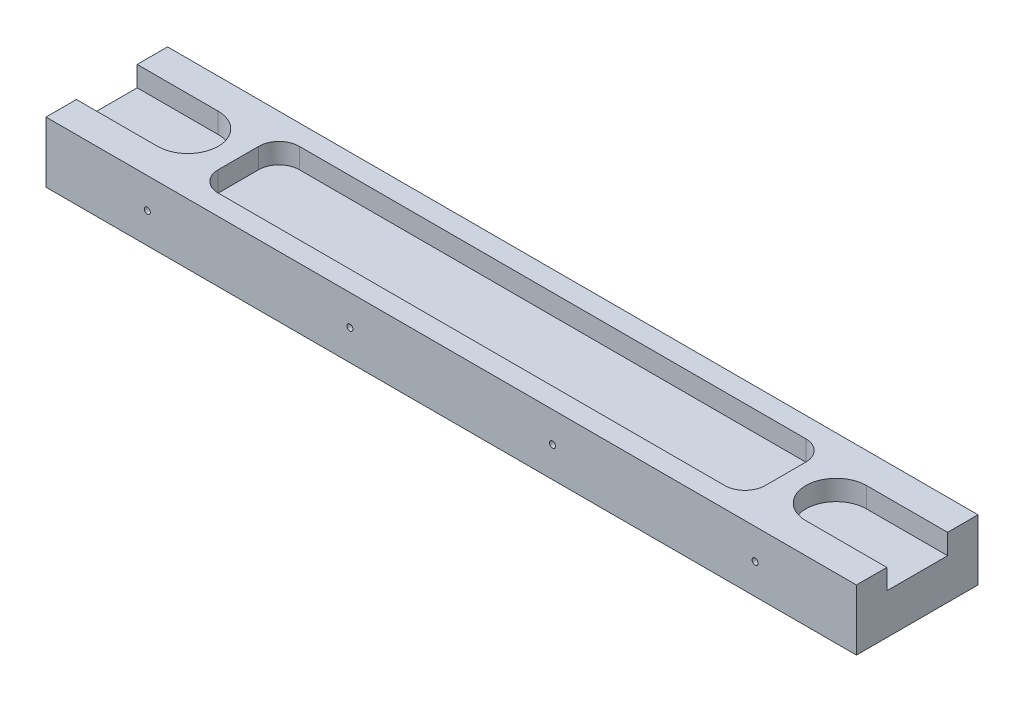
ISO-10303-21;
HEADER;
FILE_DESCRIPTION(('STEP AP214'),'2;1');
FILE_NAME('part.step','',(''),(''),'','','');
FILE_SCHEMA(('AUTOMOTIVE_DESIGN { 1 0 10303 214 1 1 1 1 }'));
ENDSEC;
DATA;
#1=APPLICATION_CONTEXT('core data for automotive mechanical design processes');
#2=APPLICATION_PROTOCOL_DEFINITION('international standard','automotive_design',2000,#1);
#3=PRODUCT_CONTEXT('',#1,'mechanical');
#4=PRODUCT('Part','Part','',(#3));
#5=PRODUCT_RELATED_PRODUCT_CATEGORY('part','',(#4));
#6=PRODUCT_DEFINITION_FORMATION('','',#4);
#7=PRODUCT_DEFINITION_CONTEXT('part definition',#1,'design');
#8=PRODUCT_DEFINITION('design','',#6,#7);
#9=PRODUCT_DEFINITION_SHAPE('','',#8);
#10=(LENGTH_UNIT() NAMED_UNIT(*) SI_UNIT(.MILLI.,.METRE.));
#11=(NAMED_UNIT(*) PLANE_ANGLE_UNIT() SI_UNIT($,.RADIAN.));
#12=(NAMED_UNIT(*) SI_UNIT($,.STERADIAN.) SOLID_ANGLE_UNIT());
#13=UNCERTAINTY_MEASURE_WITH_UNIT(LENGTH_MEASURE(1.E-05),#10,'distance_accuracy_value','');
#14=(GEOMETRIC_REPRESENTATION_CONTEXT(3) GLOBAL_UNCERTAINTY_ASSIGNED_CONTEXT((#13)) GLOBAL_UNIT_ASSIGNED_CONTEXT((#10,
#11,#12)) REPRESENTATION_CONTEXT('',''));
#15=CARTESIAN_POINT('',(0.,0.,0.));
#16=DIRECTION('',(0.,0.,1.));
#17=DIRECTION('',(1.,0.,0.));
#18=AXIS2_PLACEMENT_3D('',#15,#16,#17);
#19=CARTESIAN_POINT('',(0.,15.,0.));
#20=DIRECTION('',(1.,0.,0.));
#21=DIRECTION('',(0.,0.,-1.));
#22=AXIS2_PLACEMENT_3D('',#19,#20,#21);
#23=PLANE('',#22);
#24=DIRECTION('',(0.,0.,1.));
#25=VECTOR('',#24,1.);
#26=CARTESIAN_POINT('',(0.,10.,0.));
#27=LINE('',#26,#25);
#28=CARTESIAN_POINT('',(0.,10.,-22.5));
#29=VERTEX_POINT('',#28);
#30=CARTESIAN_POINT('',(0.,10.,-7.5));
#31=VERTEX_POINT('',#30);
#32=EDGE_CURVE('E11',#29,#31,#27,.T.);
#33=ORIENTED_EDGE('',*,*,#32,.F.);
#34=DIRECTION('',(0.,1.,0.));
#35=VECTOR('',#34,1.);
#36=CARTESIAN_POINT('',(0.,15.,-22.5));
#37=LINE('',#36,#35);
#38=CARTESIAN_POINT('',(0.,15.,-22.5));
#39=VERTEX_POINT('',#38);
#40=EDGE_CURVE('E312',#29,#39,#37,.T.);
#41=ORIENTED_EDGE('',*,*,#40,.T.);
#42=DIRECTION('',(0.,0.,1.));
#43=VECTOR('',#42,1.);
#44=CARTESIAN_POINT('',(0.,15.,0.));
#45=LINE('',#44,#43);
#46=CARTESIAN_POINT('',(0.,15.,-30.));
#47=VERTEX_POINT('',#46);
#48=EDGE_CURVE('E316',#47,#39,#45,.T.);
#49=ORIENTED_EDGE('',*,*,#48,.F.);
#50=DIRECTION('',(0.,-1.,0.));
#51=VECTOR('',#50,1.);
#52=CARTESIAN_POINT('',(0.,15.,-30.));
#53=LINE('',#52,#51);
#54=CARTESIAN_POINT('',(0.,0.,-30.));
#55=VERTEX_POINT('',#54);
#56=EDGE_CURVE('E328',#47,#55,#53,.T.);
#57=ORIENTED_EDGE('',*,*,#56,.T.);
#58=DIRECTION('',(0.,0.,1.));
#59=VECTOR('',#58,1.);
#60=CARTESIAN_POINT('',(0.,0.,0.));
#61=LINE('',#60,#59);
#62=CARTESIAN_POINT('',(0.,0.,0.));
#63=VERTEX_POINT('',#62);
#64=EDGE_CURVE('E315',#55,#63,#61,.T.);
#65=ORIENTED_EDGE('',*,*,#64,.T.);
#66=DIRECTION('',(0.,-1.,0.));
#67=VECTOR('',#66,1.);
#68=CARTESIAN_POINT('',(0.,15.,0.));
#69=LINE('',#68,#67);
#70=CARTESIAN_POINT('',(0.,15.,0.));
#71=VERTEX_POINT('',#70);
#72=EDGE_CURVE('E345',#71,#63,#69,.T.);
#73=ORIENTED_EDGE('',*,*,#72,.F.);
#74=CARTESIAN_POINT('',(0.,15.,-7.50000000000001));
#75=VERTEX_POINT('',#74);
#76=EDGE_CURVE('E320',#75,#71,#45,.T.);
#77=ORIENTED_EDGE('',*,*,#76,.F.);
#78=DIRECTION('',(0.,-1.,0.));
#79=VECTOR('',#78,1.);
#80=CARTESIAN_POINT('',(0.,15.,-7.5));
#81=LINE('',#80,#79);
#82=EDGE_CURVE('E309',#75,#31,#81,.T.);
#83=ORIENTED_EDGE('',*,*,#82,.T.);
#84=EDGE_LOOP('',(#33,#41,#49,#57,#65,#73,#77,#83));
#85=FACE_BOUND('',#84,.T.);
#86=ADVANCED_FACE('F39',(#85),#23,.F.);
#87=CARTESIAN_POINT('',(0.,15.,0.));
#88=DIRECTION('',(0.,0.,-1.));
#89=DIRECTION('',(-1.,0.,0.));
#90=AXIS2_PLACEMENT_3D('',#87,#88,#89);
#91=PLANE('',#90);
#92=CARTESIAN_POINT('',(25.,7.5,0.));
#93=DIRECTION('',(0.,0.,1.));
#94=DIRECTION('',(1.,0.,0.));
#95=AXIS2_PLACEMENT_3D('',#92,#93,#94);
#96=CIRCLE('',#95,0.750000000000002);
#97=CARTESIAN_POINT('',(25.75,7.5,0.));
#98=VERTEX_POINT('',#97);
#99=EDGE_CURVE('E246',#98,#98,#96,.T.);
#100=ORIENTED_EDGE('',*,*,#99,.F.);
#101=EDGE_LOOP('',(#100));
#102=FACE_BOUND('',#101,.T.);
#103=CARTESIAN_POINT('',(75.,7.5,0.));
#104=DIRECTION('',(0.,0.,1.));
#105=DIRECTION('',(1.,0.,0.));
#106=AXIS2_PLACEMENT_3D('',#103,#104,#105);
#107=CIRCLE('',#106,0.749999999999999);
#108=CARTESIAN_POINT('',(75.75,7.5,0.));
#109=VERTEX_POINT('',#108);
#110=EDGE_CURVE('E250',#109,#109,#107,.T.);
#111=ORIENTED_EDGE('',*,*,#110,.F.);
#112=EDGE_LOOP('',(#111));
#113=FACE_BOUND('',#112,.T.);
#114=CARTESIAN_POINT('',(125.,7.5,0.));
#115=DIRECTION('',(0.,0.,1.));
#116=DIRECTION('',(1.,0.,0.));
#117=AXIS2_PLACEMENT_3D('',#114,#115,#116);
#118=CIRCLE('',#117,0.750000000000012);
#119=CARTESIAN_POINT('',(125.75,7.5,0.));
#120=VERTEX_POINT('',#119);
#121=EDGE_CURVE('E257',#120,#120,#118,.T.);
#122=ORIENTED_EDGE('',*,*,#121,.F.);
#123=EDGE_LOOP('',(#122));
#124=FACE_BOUND('',#123,.T.);
#125=CARTESIAN_POINT('',(175.,7.5,0.));
#126=DIRECTION('',(0.,0.,1.));
#127=DIRECTION('',(1.,0.,0.));
#128=AXIS2_PLACEMENT_3D('',#125,#126,#127);
#129=CIRCLE('',#128,0.750000000000012);
#130=CARTESIAN_POINT('',(175.75,7.5,0.));
#131=VERTEX_POINT('',#130);
#132=EDGE_CURVE('E263',#131,#131,#129,.T.);
#133=ORIENTED_EDGE('',*,*,#132,.F.);
#134=EDGE_LOOP('',(#133));
#135=FACE_BOUND('',#134,.T.);
#136=DIRECTION('',(1.,0.,0.));
#137=VECTOR('',#136,1.);
#138=CARTESIAN_POINT('',(0.,0.,0.));
#139=LINE('',#138,#137);
#140=CARTESIAN_POINT('',(200.,0.,0.));
#141=VERTEX_POINT('',#140);
#142=EDGE_CURVE('E331',#63,#141,#139,.T.);
#143=ORIENTED_EDGE('',*,*,#142,.T.);
#144=DIRECTION('',(0.,-1.,0.));
#145=VECTOR('',#144,1.);
#146=CARTESIAN_POINT('',(200.,15.,0.));
#147=LINE('',#146,#145);
#148=CARTESIAN_POINT('',(200.,15.,0.));
#149=VERTEX_POINT('',#148);
#150=EDGE_CURVE('E342',#149,#141,#147,.T.);
#151=ORIENTED_EDGE('',*,*,#150,.F.);
#152=DIRECTION('',(1.,0.,0.));
#153=VECTOR('',#152,1.);
#154=CARTESIAN_POINT('',(0.,15.,0.));
#155=LINE('',#154,#153);
#156=EDGE_CURVE('E319',#71,#149,#155,.T.);
#157=ORIENTED_EDGE('',*,*,#156,.F.);
#158=ORIENTED_EDGE('',*,*,#72,.T.);
#159=EDGE_LOOP('',(#143,#151,#157,#158));
#160=FACE_BOUND('',#159,.T.);
#161=ADVANCED_FACE('F401',(#102,#113,#124,#135,#160),#91,.F.);
#162=CARTESIAN_POINT('',(200.,15.,0.));
#163=DIRECTION('',(-1.,0.,0.));
#164=DIRECTION('',(0.,0.,1.));
#165=AXIS2_PLACEMENT_3D('',#162,#163,#164);
#166=PLANE('',#165);
#167=DIRECTION('',(0.,0.,1.));
#168=VECTOR('',#167,1.);
#169=CARTESIAN_POINT('',(200.,10.,0.));
#170=LINE('',#169,#168);
#171=CARTESIAN_POINT('',(200.,10.,-22.5));
#172=VERTEX_POINT('',#171);
#173=CARTESIAN_POINT('',(200.,10.,-7.5));
#174=VERTEX_POINT('',#173);
#175=EDGE_CURVE('E46',#172,#174,#170,.T.);
#176=ORIENTED_EDGE('',*,*,#175,.T.);
#177=DIRECTION('',(0.,1.,0.));
#178=VECTOR('',#177,1.);
#179=CARTESIAN_POINT('',(200.,15.,-7.5));
#180=LINE('',#179,#178);
#181=CARTESIAN_POINT('',(200.,15.,-7.5));
#182=VERTEX_POINT('',#181);
#183=EDGE_CURVE('E306',#174,#182,#180,.T.);
#184=ORIENTED_EDGE('',*,*,#183,.T.);
#185=DIRECTION('',(0.,0.,-1.));
#186=VECTOR('',#185,1.);
#187=CARTESIAN_POINT('',(200.,15.,0.));
#188=LINE('',#187,#186);
#189=EDGE_CURVE('E323',#149,#182,#188,.T.);
#190=ORIENTED_EDGE('',*,*,#189,.F.);
#191=ORIENTED_EDGE('',*,*,#150,.T.);
#192=DIRECTION('',(0.,0.,-1.));
#193=VECTOR('',#192,1.);
#194=CARTESIAN_POINT('',(200.,0.,0.));
#195=LINE('',#194,#193);
#196=CARTESIAN_POINT('',(200.,0.,-30.));
#197=VERTEX_POINT('',#196);
#198=EDGE_CURVE('E333',#141,#197,#195,.T.);
#199=ORIENTED_EDGE('',*,*,#198,.T.);
#200=DIRECTION('',(0.,-1.,0.));
#201=VECTOR('',#200,1.);
#202=CARTESIAN_POINT('',(200.,15.,-30.));
#203=LINE('',#202,#201);
#204=CARTESIAN_POINT('',(200.,15.,-30.));
#205=VERTEX_POINT('',#204);
#206=EDGE_CURVE('E339',#205,#197,#203,.T.);
#207=ORIENTED_EDGE('',*,*,#206,.F.);
#208=CARTESIAN_POINT('',(200.,15.,-22.5));
#209=VERTEX_POINT('',#208);
#210=EDGE_CURVE('E322',#209,#205,#188,.T.);
#211=ORIENTED_EDGE('',*,*,#210,.F.);
#212=DIRECTION('',(0.,-1.,0.));
#213=VECTOR('',#212,1.);
#214=CARTESIAN_POINT('',(200.,15.,-22.5));
#215=LINE('',#214,#213);
#216=EDGE_CURVE('E61',#209,#172,#215,.T.);
#217=ORIENTED_EDGE('',*,*,#216,.T.);
#218=EDGE_LOOP('',(#176,#184,#190,#191,#199,#207,#211,#217));
#219=FACE_BOUND('',#218,.T.);
#220=ADVANCED_FACE('F354',(#219),#166,.F.);
#221=CARTESIAN_POINT('',(0.,15.,-30.));
#222=DIRECTION('',(0.,0.,1.));
#223=DIRECTION('',(1.,0.,0.));
#224=AXIS2_PLACEMENT_3D('',#221,#222,#223);
#225=PLANE('',#224);
#226=CARTESIAN_POINT('',(25.,7.5,-30.));
#227=DIRECTION('',(0.,0.,1.));
#228=DIRECTION('',(1.,0.,0.));
#229=AXIS2_PLACEMENT_3D('',#226,#227,#228);
#230=CIRCLE('',#229,0.750000000000002);
#231=CARTESIAN_POINT('',(25.75,7.5,-30.));
#232=VERTEX_POINT('',#231);
#233=EDGE_CURVE('E249',#232,#232,#230,.F.);
#234=ORIENTED_EDGE('',*,*,#233,.F.);
#235=EDGE_LOOP('',(#234));
#236=FACE_BOUND('',#235,.T.);
#237=CARTESIAN_POINT('',(75.,7.5,-30.));
#238=DIRECTION('',(0.,0.,1.));
#239=DIRECTION('',(1.,0.,0.));
#240=AXIS2_PLACEMENT_3D('',#237,#238,#239);
#241=CIRCLE('',#240,0.749999999999999);
#242=CARTESIAN_POINT('',(75.75,7.5,-30.));
#243=VERTEX_POINT('',#242);
#244=EDGE_CURVE('E254',#243,#243,#241,.F.);
#245=ORIENTED_EDGE('',*,*,#244,.F.);
#246=EDGE_LOOP('',(#245));
#247=FACE_BOUND('',#246,.T.);
#248=CARTESIAN_POINT('',(125.,7.5,-30.));
#249=DIRECTION('',(0.,0.,1.));
#250=DIRECTION('',(1.,0.,0.));
#251=AXIS2_PLACEMENT_3D('',#248,#249,#250);
#252=CIRCLE('',#251,0.750000000000012);
#253=CARTESIAN_POINT('',(125.75,7.5,-30.));
#254=VERTEX_POINT('',#253);
#255=EDGE_CURVE('E260',#254,#254,#252,.F.);
#256=ORIENTED_EDGE('',*,*,#255,.F.);
#257=EDGE_LOOP('',(#256));
#258=FACE_BOUND('',#257,.T.);
#259=CARTESIAN_POINT('',(175.,7.5,-30.));
#260=DIRECTION('',(0.,0.,1.));
#261=DIRECTION('',(1.,0.,0.));
#262=AXIS2_PLACEMENT_3D('',#259,#260,#261);
#263=CIRCLE('',#262,0.750000000000012);
#264=CARTESIAN_POINT('',(175.75,7.5,-30.));
#265=VERTEX_POINT('',#264);
#266=EDGE_CURVE('E234',#265,#265,#263,.F.);
#267=ORIENTED_EDGE('',*,*,#266,.F.);
#268=EDGE_LOOP('',(#267));
#269=FACE_BOUND('',#268,.T.);
#270=DIRECTION('',(-1.,0.,0.));
#271=VECTOR('',#270,1.);
#272=CARTESIAN_POINT('',(0.,0.,-30.));
#273=LINE('',#272,#271);
#274=EDGE_CURVE('E335',#197,#55,#273,.T.);
#275=ORIENTED_EDGE('',*,*,#274,.T.);
#276=ORIENTED_EDGE('',*,*,#56,.F.);
#277=DIRECTION('',(-1.,0.,0.));
#278=VECTOR('',#277,1.);
#279=CARTESIAN_POINT('',(0.,15.,-30.));
#280=LINE('',#279,#278);
#281=EDGE_CURVE('E326',#205,#47,#280,.T.);
#282=ORIENTED_EDGE('',*,*,#281,.F.);
#283=ORIENTED_EDGE('',*,*,#206,.T.);
#284=EDGE_LOOP('',(#275,#276,#282,#283));
#285=FACE_BOUND('',#284,.T.);
#286=ADVANCED_FACE('F382',(#236,#247,#258,#269,#285),#225,.F.);
#287=CARTESIAN_POINT('',(0.,15.,0.));
#288=DIRECTION('',(0.,-1.,0.));
#289=DIRECTION('',(0.,0.,-1.));
#290=AXIS2_PLACEMENT_3D('',#287,#288,#289);
#291=PLANE('',#290);
#292=DIRECTION('',(0.,0.,1.));
#293=VECTOR('',#292,1.);
#294=CARTESIAN_POINT('',(32.5,15.,-20.));
#295=LINE('',#294,#293);
#296=CARTESIAN_POINT('',(32.5,15.,-20.));
#297=VERTEX_POINT('',#296);
#298=CARTESIAN_POINT('',(32.5,15.,-10.));
#299=VERTEX_POINT('',#298);
#300=EDGE_CURVE('E216',#297,#299,#295,.T.);
#301=ORIENTED_EDGE('',*,*,#300,.F.);
#302=CARTESIAN_POINT('',(37.5,15.,-20.));
#303=DIRECTION('',(0.,1.,0.));
#304=DIRECTION('',(0.,0.,1.));
#305=AXIS2_PLACEMENT_3D('',#302,#303,#304);
#306=CIRCLE('',#305,5.);
#307=CARTESIAN_POINT('',(37.5,15.,-25.));
#308=VERTEX_POINT('',#307);
#309=EDGE_CURVE('E53',#308,#297,#306,.T.);
#310=ORIENTED_EDGE('',*,*,#309,.F.);
#311=DIRECTION('',(-1.,0.,0.));
#312=VECTOR('',#311,1.);
#313=CARTESIAN_POINT('',(37.5,15.,-25.));
#314=LINE('',#313,#312);
#315=CARTESIAN_POINT('',(162.5,15.,-25.));
#316=VERTEX_POINT('',#315);
#317=EDGE_CURVE('E196',#316,#308,#314,.T.);
#318=ORIENTED_EDGE('',*,*,#317,.F.);
#319=CARTESIAN_POINT('',(162.5,15.,-20.));
#320=DIRECTION('',(0.,1.,0.));
#321=DIRECTION('',(0.,0.,-1.));
#322=AXIS2_PLACEMENT_3D('',#319,#320,#321);
#323=CIRCLE('',#322,5.);
#324=CARTESIAN_POINT('',(167.5,15.,-20.));
#325=VERTEX_POINT('',#324);
#326=EDGE_CURVE('E199',#325,#316,#323,.T.);
#327=ORIENTED_EDGE('',*,*,#326,.F.);
#328=DIRECTION('',(0.,0.,-1.));
#329=VECTOR('',#328,1.);
#330=CARTESIAN_POINT('',(167.5,15.,-20.));
#331=LINE('',#330,#329);
#332=CARTESIAN_POINT('',(167.5,15.,-10.));
#333=VERTEX_POINT('',#332);
#334=EDGE_CURVE('E227',#333,#325,#331,.T.);
#335=ORIENTED_EDGE('',*,*,#334,.F.);
#336=CARTESIAN_POINT('',(162.5,15.,-10.));
#337=DIRECTION('',(0.,1.,0.));
#338=DIRECTION('',(0.,0.,1.));
#339=AXIS2_PLACEMENT_3D('',#336,#337,#338);
#340=CIRCLE('',#339,5.);
#341=CARTESIAN_POINT('',(162.5,15.,-5.));
#342=VERTEX_POINT('',#341);
#343=EDGE_CURVE('E224',#342,#333,#340,.T.);
#344=ORIENTED_EDGE('',*,*,#343,.F.);
#345=DIRECTION('',(1.,0.,0.));
#346=VECTOR('',#345,1.);
#347=CARTESIAN_POINT('',(37.5,15.,-5.));
#348=LINE('',#347,#346);
#349=CARTESIAN_POINT('',(37.5,15.,-5.));
#350=VERTEX_POINT('',#349);
#351=EDGE_CURVE('E221',#350,#342,#348,.T.);
#352=ORIENTED_EDGE('',*,*,#351,.F.);
#353=CARTESIAN_POINT('',(37.5,15.,-10.));
#354=DIRECTION('',(0.,1.,0.));
#355=DIRECTION('',(0.,0.,1.));
#356=AXIS2_PLACEMENT_3D('',#353,#354,#355);
#357=CIRCLE('',#356,5.);
#358=EDGE_CURVE('E218',#299,#350,#357,.T.);
#359=ORIENTED_EDGE('',*,*,#358,.F.);
#360=EDGE_LOOP('',(#301,#310,#318,#327,#335,#344,#352,#359));
#361=FACE_BOUND('',#360,.T.);
#362=ORIENTED_EDGE('',*,*,#48,.T.);
#363=DIRECTION('',(-1.,0.,0.));
#364=VECTOR('',#363,1.);
#365=CARTESIAN_POINT('',(-20.,15.,-22.5));
#366=LINE('',#365,#364);
#367=CARTESIAN_POINT('',(20.,15.,-22.5));
#368=VERTEX_POINT('',#367);
#369=EDGE_CURVE('E273',#368,#39,#366,.T.);
#370=ORIENTED_EDGE('',*,*,#369,.F.);
#371=CARTESIAN_POINT('',(20.,15.,-15.));
#372=DIRECTION('',(0.,1.,0.));
#373=DIRECTION('',(0.,0.,1.));
#374=AXIS2_PLACEMENT_3D('',#371,#372,#373);
#375=CIRCLE('',#374,7.5);
#376=CARTESIAN_POINT('',(20.,15.,-7.50000000000001));
#377=VERTEX_POINT('',#376);
#378=EDGE_CURVE('E280',#377,#368,#375,.T.);
#379=ORIENTED_EDGE('',*,*,#378,.F.);
#380=DIRECTION('',(-1.,0.,0.));
#381=VECTOR('',#380,1.);
#382=CARTESIAN_POINT('',(0.,15.,-7.5));
#383=LINE('',#382,#381);
#384=EDGE_CURVE('E350',#377,#75,#383,.T.);
#385=ORIENTED_EDGE('',*,*,#384,.T.);
#386=ORIENTED_EDGE('',*,*,#76,.T.);
#387=ORIENTED_EDGE('',*,*,#156,.T.);
#388=ORIENTED_EDGE('',*,*,#189,.T.);
#389=DIRECTION('',(1.,0.,0.));
#390=VECTOR('',#389,1.);
#391=CARTESIAN_POINT('',(220.,15.,-7.5));
#392=LINE('',#391,#390);
#393=CARTESIAN_POINT('',(180.,15.,-7.50000000000001));
#394=VERTEX_POINT('',#393);
#395=EDGE_CURVE('E294',#394,#182,#392,.T.);
#396=ORIENTED_EDGE('',*,*,#395,.F.);
#397=CARTESIAN_POINT('',(180.,15.,-15.));
#398=DIRECTION('',(0.,1.,0.));
#399=DIRECTION('',(0.,0.,-1.));
#400=AXIS2_PLACEMENT_3D('',#397,#398,#399);
#401=CIRCLE('',#400,7.5);
#402=CARTESIAN_POINT('',(180.,15.,-22.5));
#403=VERTEX_POINT('',#402);
#404=EDGE_CURVE('E283',#403,#394,#401,.T.);
#405=ORIENTED_EDGE('',*,*,#404,.F.);
#406=DIRECTION('',(1.,0.,0.));
#407=VECTOR('',#406,1.);
#408=CARTESIAN_POINT('',(0.,15.,-22.5));
#409=LINE('',#408,#407);
#410=EDGE_CURVE('E348',#403,#209,#409,.T.);
#411=ORIENTED_EDGE('',*,*,#410,.T.);
#412=ORIENTED_EDGE('',*,*,#210,.T.);
#413=ORIENTED_EDGE('',*,*,#281,.T.);
#414=EDGE_LOOP('',(#362,#370,#379,#385,#386,#387,#388,#396,#405,#411,#412,#413));
#415=FACE_BOUND('',#414,.T.);
#416=ADVANCED_FACE('F370',(#361,#415),#291,.F.);
#417=CARTESIAN_POINT('',(0.,0.,0.));
#418=DIRECTION('',(0.,-1.,0.));
#419=DIRECTION('',(0.,0.,-1.));
#420=AXIS2_PLACEMENT_3D('',#417,#418,#419);
#421=PLANE('',#420);
#422=ORIENTED_EDGE('',*,*,#64,.F.);
#423=ORIENTED_EDGE('',*,*,#274,.F.);
#424=ORIENTED_EDGE('',*,*,#198,.F.);
#425=ORIENTED_EDGE('',*,*,#142,.F.);
#426=EDGE_LOOP('',(#422,#423,#424,#425));
#427=FACE_BOUND('',#426,.T.);
#428=ADVANCED_FACE('F379',(#427),#421,.T.);
#429=CARTESIAN_POINT('',(220.,10.,-15.));
#430=DIRECTION('',(0.,-1.,0.));
#431=DIRECTION('',(0.,0.,-1.));
#432=AXIS2_PLACEMENT_3D('',#429,#430,#431);
#433=PLANE('',#432);
#434=DIRECTION('',(-1.,0.,0.));
#435=VECTOR('',#434,1.);
#436=CARTESIAN_POINT('',(220.,10.,-22.5));
#437=LINE('',#436,#435);
#438=CARTESIAN_POINT('',(180.,10.,-22.5));
#439=VERTEX_POINT('',#438);
#440=EDGE_CURVE('E296',#172,#439,#437,.T.);
#441=ORIENTED_EDGE('',*,*,#440,.T.);
#442=CARTESIAN_POINT('',(180.,10.,-15.));
#443=DIRECTION('',(0.,1.,0.));
#444=DIRECTION('',(0.,0.,-1.));
#445=AXIS2_PLACEMENT_3D('',#442,#443,#444);
#446=CIRCLE('',#445,7.5);
#447=CARTESIAN_POINT('',(180.,10.,-7.50000000000001));
#448=VERTEX_POINT('',#447);
#449=EDGE_CURVE('E301',#439,#448,#446,.T.);
#450=ORIENTED_EDGE('',*,*,#449,.T.);
#451=DIRECTION('',(1.,0.,0.));
#452=VECTOR('',#451,1.);
#453=CARTESIAN_POINT('',(220.,10.,-7.5));
#454=LINE('',#453,#452);
#455=EDGE_CURVE('E292',#448,#174,#454,.T.);
#456=ORIENTED_EDGE('',*,*,#455,.T.);
#457=ORIENTED_EDGE('',*,*,#175,.F.);
#458=EDGE_LOOP('',(#441,#450,#456,#457));
#459=FACE_BOUND('',#458,.T.);
#460=ADVANCED_FACE('F358',(#459),#433,.F.);
#461=CARTESIAN_POINT('',(220.,10.,-7.5));
#462=DIRECTION('',(0.,0.,1.));
#463=DIRECTION('',(1.,0.,0.));
#464=AXIS2_PLACEMENT_3D('',#461,#462,#463);
#465=PLANE('',#464);
#466=ORIENTED_EDGE('',*,*,#455,.F.);
#467=DIRECTION('',(0.,1.,0.));
#468=VECTOR('',#467,1.);
#469=CARTESIAN_POINT('',(180.,10.,-7.50000000000001));
#470=LINE('',#469,#468);
#471=EDGE_CURVE('E253',#448,#394,#470,.T.);
#472=ORIENTED_EDGE('',*,*,#471,.T.);
#473=ORIENTED_EDGE('',*,*,#395,.T.);
#474=ORIENTED_EDGE('',*,*,#183,.F.);
#475=EDGE_LOOP('',(#466,#472,#473,#474));
#476=FACE_BOUND('',#475,.T.);
#477=ADVANCED_FACE('F367',(#476),#465,.F.);
#478=CARTESIAN_POINT('',(220.,10.,-22.5));
#479=DIRECTION('',(0.,0.,-1.));
#480=DIRECTION('',(-1.,0.,0.));
#481=AXIS2_PLACEMENT_3D('',#478,#479,#480);
#482=PLANE('',#481);
#483=ORIENTED_EDGE('',*,*,#410,.F.);
#484=DIRECTION('',(0.,1.,0.));
#485=VECTOR('',#484,1.);
#486=CARTESIAN_POINT('',(180.,10.,-22.5));
#487=LINE('',#486,#485);
#488=EDGE_CURVE('E289',#439,#403,#487,.T.);
#489=ORIENTED_EDGE('',*,*,#488,.F.);
#490=ORIENTED_EDGE('',*,*,#440,.F.);
#491=ORIENTED_EDGE('',*,*,#216,.F.);
#492=EDGE_LOOP('',(#483,#489,#490,#491));
#493=FACE_BOUND('',#492,.T.);
#494=ADVANCED_FACE('F361',(#493),#482,.F.);
#495=CARTESIAN_POINT('',(180.,10.,-15.));
#496=DIRECTION('',(0.,1.,0.));
#497=DIRECTION('',(0.,0.,1.));
#498=AXIS2_PLACEMENT_3D('',#495,#496,#497);
#499=CYLINDRICAL_SURFACE('',#498,7.5);
#500=ORIENTED_EDGE('',*,*,#404,.T.);
#501=ORIENTED_EDGE('',*,*,#471,.F.);
#502=ORIENTED_EDGE('',*,*,#449,.F.);
#503=ORIENTED_EDGE('',*,*,#488,.T.);
#504=EDGE_LOOP('',(#500,#501,#502,#503));
#505=FACE_BOUND('',#504,.T.);
#506=ADVANCED_FACE('F365',(#505),#499,.F.);
#507=CARTESIAN_POINT('',(-20.,10.,-15.));
#508=DIRECTION('',(0.,1.,0.));
#509=DIRECTION('',(0.,0.,1.));
#510=AXIS2_PLACEMENT_3D('',#507,#508,#509);
#511=PLANE('',#510);
#512=ORIENTED_EDGE('',*,*,#32,.T.);
#513=DIRECTION('',(1.,0.,0.));
#514=VECTOR('',#513,1.);
#515=CARTESIAN_POINT('',(-20.,10.,-7.5));
#516=LINE('',#515,#514);
#517=CARTESIAN_POINT('',(20.,10.,-7.50000000000001));
#518=VERTEX_POINT('',#517);
#519=EDGE_CURVE('E270',#31,#518,#516,.T.);
#520=ORIENTED_EDGE('',*,*,#519,.T.);
#521=CARTESIAN_POINT('',(20.,10.,-15.));
#522=DIRECTION('',(0.,1.,0.));
#523=DIRECTION('',(0.,0.,1.));
#524=AXIS2_PLACEMENT_3D('',#521,#522,#523);
#525=CIRCLE('',#524,7.5);
#526=CARTESIAN_POINT('',(20.,10.,-22.5));
#527=VERTEX_POINT('',#526);
#528=EDGE_CURVE('E272',#518,#527,#525,.T.);
#529=ORIENTED_EDGE('',*,*,#528,.T.);
#530=DIRECTION('',(-1.,0.,0.));
#531=VECTOR('',#530,1.);
#532=CARTESIAN_POINT('',(-20.,10.,-22.5));
#533=LINE('',#532,#531);
#534=EDGE_CURVE('E276',#527,#29,#533,.T.);
#535=ORIENTED_EDGE('',*,*,#534,.T.);
#536=EDGE_LOOP('',(#512,#520,#529,#535));
#537=FACE_BOUND('',#536,.T.);
#538=ADVANCED_FACE('F427',(#537),#511,.T.);
#539=CARTESIAN_POINT('',(-20.,10.,-22.5));
#540=DIRECTION('',(0.,0.,-1.));
#541=DIRECTION('',(-1.,0.,0.));
#542=AXIS2_PLACEMENT_3D('',#539,#540,#541);
#543=PLANE('',#542);
#544=ORIENTED_EDGE('',*,*,#534,.F.);
#545=DIRECTION('',(0.,1.,0.));
#546=VECTOR('',#545,1.);
#547=CARTESIAN_POINT('',(20.,10.,-22.5));
#548=LINE('',#547,#546);
#549=EDGE_CURVE('E285',#527,#368,#548,.T.);
#550=ORIENTED_EDGE('',*,*,#549,.T.);
#551=ORIENTED_EDGE('',*,*,#369,.T.);
#552=ORIENTED_EDGE('',*,*,#40,.F.);
#553=EDGE_LOOP('',(#544,#550,#551,#552));
#554=FACE_BOUND('',#553,.T.);
#555=ADVANCED_FACE('F392',(#554),#543,.F.);
#556=CARTESIAN_POINT('',(-20.,10.,-7.5));
#557=DIRECTION('',(0.,0.,1.));
#558=DIRECTION('',(1.,0.,0.));
#559=AXIS2_PLACEMENT_3D('',#556,#557,#558);
#560=PLANE('',#559);
#561=ORIENTED_EDGE('',*,*,#384,.F.);
#562=DIRECTION('',(0.,1.,0.));
#563=VECTOR('',#562,1.);
#564=CARTESIAN_POINT('',(20.,10.,-7.50000000000001));
#565=LINE('',#564,#563);
#566=EDGE_CURVE('E279',#518,#377,#565,.T.);
#567=ORIENTED_EDGE('',*,*,#566,.F.);
#568=ORIENTED_EDGE('',*,*,#519,.F.);
#569=ORIENTED_EDGE('',*,*,#82,.F.);
#570=EDGE_LOOP('',(#561,#567,#568,#569));
#571=FACE_BOUND('',#570,.T.);
#572=ADVANCED_FACE('F399',(#571),#560,.F.);
#573=CARTESIAN_POINT('',(20.,10.,-15.));
#574=DIRECTION('',(0.,1.,0.));
#575=DIRECTION('',(0.,0.,1.));
#576=AXIS2_PLACEMENT_3D('',#573,#574,#575);
#577=CYLINDRICAL_SURFACE('',#576,7.5);
#578=ORIENTED_EDGE('',*,*,#378,.T.);
#579=ORIENTED_EDGE('',*,*,#549,.F.);
#580=ORIENTED_EDGE('',*,*,#528,.F.);
#581=ORIENTED_EDGE('',*,*,#566,.T.);
#582=EDGE_LOOP('',(#578,#579,#580,#581));
#583=FACE_BOUND('',#582,.T.);
#584=ADVANCED_FACE('F395',(#583),#577,.F.);
#585=CARTESIAN_POINT('',(175.,7.5,-32.1213203435597));
#586=DIRECTION('',(0.,0.,1.));
#587=DIRECTION('',(1.,0.,0.));
#588=AXIS2_PLACEMENT_3D('',#585,#586,#587);
#589=CYLINDRICAL_SURFACE('',#588,0.750000000000012);
#590=ORIENTED_EDGE('',*,*,#266,.T.);
#591=EDGE_LOOP('',(#590));
#592=FACE_BOUND('',#591,.T.);
#593=ORIENTED_EDGE('',*,*,#132,.T.);
#594=EDGE_LOOP('',(#593));
#595=FACE_BOUND('',#594,.T.);
#596=ADVANCED_FACE('F433',(#592,#595),#589,.F.);
#597=CARTESIAN_POINT('',(125.,7.5,-32.1213203435597));
#598=DIRECTION('',(0.,0.,1.));
#599=DIRECTION('',(1.,0.,0.));
#600=AXIS2_PLACEMENT_3D('',#597,#598,#599);
#601=CYLINDRICAL_SURFACE('',#600,0.750000000000012);
#602=ORIENTED_EDGE('',*,*,#255,.T.);
#603=EDGE_LOOP('',(#602));
#604=FACE_BOUND('',#603,.T.);
#605=ORIENTED_EDGE('',*,*,#121,.T.);
#606=EDGE_LOOP('',(#605));
#607=FACE_BOUND('',#606,.T.);
#608=ADVANCED_FACE('F441',(#604,#607),#601,.F.);
#609=CARTESIAN_POINT('',(75.,7.5,-32.1213203435597));
#610=DIRECTION('',(0.,0.,1.));
#611=DIRECTION('',(1.,0.,0.));
#612=AXIS2_PLACEMENT_3D('',#609,#610,#611);
#613=CYLINDRICAL_SURFACE('',#612,0.749999999999999);
#614=ORIENTED_EDGE('',*,*,#244,.T.);
#615=EDGE_LOOP('',(#614));
#616=FACE_BOUND('',#615,.T.);
#617=ORIENTED_EDGE('',*,*,#110,.T.);
#618=EDGE_LOOP('',(#617));
#619=FACE_BOUND('',#618,.T.);
#620=ADVANCED_FACE('F445',(#616,#619),#613,.F.);
#621=CARTESIAN_POINT('',(25.,7.5,-32.1213203435597));
#622=DIRECTION('',(0.,0.,1.));
#623=DIRECTION('',(1.,0.,0.));
#624=AXIS2_PLACEMENT_3D('',#621,#622,#623);
#625=CYLINDRICAL_SURFACE('',#624,0.750000000000002);
#626=ORIENTED_EDGE('',*,*,#233,.T.);
#627=EDGE_LOOP('',(#626));
#628=FACE_BOUND('',#627,.T.);
#629=ORIENTED_EDGE('',*,*,#99,.T.);
#630=EDGE_LOOP('',(#629));
#631=FACE_BOUND('',#630,.T.);
#632=ADVANCED_FACE('F449',(#628,#631),#625,.F.);
#633=CARTESIAN_POINT('',(37.5,10.,-20.));
#634=DIRECTION('',(0.,1.,0.));
#635=DIRECTION('',(0.,0.,1.));
#636=AXIS2_PLACEMENT_3D('',#633,#634,#635);
#637=CYLINDRICAL_SURFACE('',#636,5.);
#638=ORIENTED_EDGE('',*,*,#309,.T.);
#639=DIRECTION('',(0.,1.,0.));
#640=VECTOR('',#639,1.);
#641=CARTESIAN_POINT('',(32.5,10.,-20.));
#642=LINE('',#641,#640);
#643=CARTESIAN_POINT('',(32.5,10.,-20.));
#644=VERTEX_POINT('',#643);
#645=EDGE_CURVE('E173',#644,#297,#642,.T.);
#646=ORIENTED_EDGE('',*,*,#645,.F.);
#647=CARTESIAN_POINT('',(37.5,10.,-20.));
#648=DIRECTION('',(0.,1.,0.));
#649=DIRECTION('',(0.,0.,1.));
#650=AXIS2_PLACEMENT_3D('',#647,#648,#649);
#651=CIRCLE('',#650,5.);
#652=CARTESIAN_POINT('',(37.5,10.,-25.));
#653=VERTEX_POINT('',#652);
#654=EDGE_CURVE('E177',#653,#644,#651,.T.);
#655=ORIENTED_EDGE('',*,*,#654,.F.);
#656=DIRECTION('',(0.,1.,0.));
#657=VECTOR('',#656,1.);
#658=CARTESIAN_POINT('',(37.5,10.,-25.));
#659=LINE('',#658,#657);
#660=EDGE_CURVE('E232',#653,#308,#659,.T.);
#661=ORIENTED_EDGE('',*,*,#660,.T.);
#662=EDGE_LOOP('',(#638,#646,#655,#661));
#663=FACE_BOUND('',#662,.T.);
#664=ADVANCED_FACE('F175',(#663),#637,.F.);
#665=CARTESIAN_POINT('',(37.5,10.,-25.));
#666=DIRECTION('',(0.,0.,-1.));
#667=DIRECTION('',(-1.,0.,0.));
#668=AXIS2_PLACEMENT_3D('',#665,#666,#667);
#669=PLANE('',#668);
#670=ORIENTED_EDGE('',*,*,#317,.T.);
#671=ORIENTED_EDGE('',*,*,#660,.F.);
#672=DIRECTION('',(-1.,0.,0.));
#673=VECTOR('',#672,1.);
#674=CARTESIAN_POINT('',(37.5,10.,-25.));
#675=LINE('',#674,#673);
#676=CARTESIAN_POINT('',(162.5,10.,-25.));
#677=VERTEX_POINT('',#676);
#678=EDGE_CURVE('E183',#677,#653,#675,.T.);
#679=ORIENTED_EDGE('',*,*,#678,.F.);
#680=DIRECTION('',(0.,1.,0.));
#681=VECTOR('',#680,1.);
#682=CARTESIAN_POINT('',(162.5,10.,-25.));
#683=LINE('',#682,#681);
#684=EDGE_CURVE('E235',#677,#316,#683,.T.);
#685=ORIENTED_EDGE('',*,*,#684,.T.);
#686=EDGE_LOOP('',(#670,#671,#679,#685));
#687=FACE_BOUND('',#686,.T.);
#688=ADVANCED_FACE('F456',(#687),#669,.F.);
#689=CARTESIAN_POINT('',(162.5,10.,-20.));
#690=DIRECTION('',(0.,1.,0.));
#691=DIRECTION('',(0.,0.,1.));
#692=AXIS2_PLACEMENT_3D('',#689,#690,#691);
#693=CYLINDRICAL_SURFACE('',#692,5.);
#694=ORIENTED_EDGE('',*,*,#326,.T.);
#695=ORIENTED_EDGE('',*,*,#684,.F.);
#696=CARTESIAN_POINT('',(162.5,10.,-20.));
#697=DIRECTION('',(0.,1.,0.));
#698=DIRECTION('',(0.,0.,-1.));
#699=AXIS2_PLACEMENT_3D('',#696,#697,#698);
#700=CIRCLE('',#699,5.);
#701=CARTESIAN_POINT('',(167.5,10.,-20.));
#702=VERTEX_POINT('',#701);
#703=EDGE_CURVE('E212',#702,#677,#700,.T.);
#704=ORIENTED_EDGE('',*,*,#703,.F.);
#705=DIRECTION('',(0.,1.,0.));
#706=VECTOR('',#705,1.);
#707=CARTESIAN_POINT('',(167.5,10.,-20.));
#708=LINE('',#707,#706);
#709=EDGE_CURVE('E237',#702,#325,#708,.T.);
#710=ORIENTED_EDGE('',*,*,#709,.T.);
#711=EDGE_LOOP('',(#694,#695,#704,#710));
#712=FACE_BOUND('',#711,.T.);
#713=ADVANCED_FACE('F474',(#712),#693,.F.);
#714=CARTESIAN_POINT('',(167.5,10.,-20.));
#715=DIRECTION('',(1.,0.,0.));
#716=DIRECTION('',(0.,0.,-1.));
#717=AXIS2_PLACEMENT_3D('',#714,#715,#716);
#718=PLANE('',#717);
#719=ORIENTED_EDGE('',*,*,#334,.T.);
#720=ORIENTED_EDGE('',*,*,#709,.F.);
#721=DIRECTION('',(0.,0.,-1.));
#722=VECTOR('',#721,1.);
#723=CARTESIAN_POINT('',(167.5,10.,-20.));
#724=LINE('',#723,#722);
#725=CARTESIAN_POINT('',(167.5,10.,-10.));
#726=VERTEX_POINT('',#725);
#727=EDGE_CURVE('E209',#726,#702,#724,.T.);
#728=ORIENTED_EDGE('',*,*,#727,.F.);
#729=DIRECTION('',(0.,1.,0.));
#730=VECTOR('',#729,1.);
#731=CARTESIAN_POINT('',(167.5,10.,-10.));
#732=LINE('',#731,#730);
#733=EDGE_CURVE('E239',#726,#333,#732,.T.);
#734=ORIENTED_EDGE('',*,*,#733,.T.);
#735=EDGE_LOOP('',(#719,#720,#728,#734));
#736=FACE_BOUND('',#735,.T.);
#737=ADVANCED_FACE('F470',(#736),#718,.F.);
#738=CARTESIAN_POINT('',(162.5,10.,-10.));
#739=DIRECTION('',(0.,1.,0.));
#740=DIRECTION('',(0.,0.,1.));
#741=AXIS2_PLACEMENT_3D('',#738,#739,#740);
#742=CYLINDRICAL_SURFACE('',#741,5.);
#743=ORIENTED_EDGE('',*,*,#343,.T.);
#744=ORIENTED_EDGE('',*,*,#733,.F.);
#745=CARTESIAN_POINT('',(162.5,10.,-10.));
#746=DIRECTION('',(0.,1.,0.));
#747=DIRECTION('',(0.,0.,1.));
#748=AXIS2_PLACEMENT_3D('',#745,#746,#747);
#749=CIRCLE('',#748,5.);
#750=CARTESIAN_POINT('',(162.5,10.,-5.));
#751=VERTEX_POINT('',#750);
#752=EDGE_CURVE('E206',#751,#726,#749,.T.);
#753=ORIENTED_EDGE('',*,*,#752,.F.);
#754=DIRECTION('',(0.,1.,0.));
#755=VECTOR('',#754,1.);
#756=CARTESIAN_POINT('',(162.5,10.,-5.));
#757=LINE('',#756,#755);
#758=EDGE_CURVE('E241',#751,#342,#757,.T.);
#759=ORIENTED_EDGE('',*,*,#758,.T.);
#760=EDGE_LOOP('',(#743,#744,#753,#759));
#761=FACE_BOUND('',#760,.T.);
#762=ADVANCED_FACE('F466',(#761),#742,.F.);
#763=CARTESIAN_POINT('',(37.5,10.,-5.));
#764=DIRECTION('',(0.,0.,1.));
#765=DIRECTION('',(1.,0.,0.));
#766=AXIS2_PLACEMENT_3D('',#763,#764,#765);
#767=PLANE('',#766);
#768=ORIENTED_EDGE('',*,*,#351,.T.);
#769=ORIENTED_EDGE('',*,*,#758,.F.);
#770=DIRECTION('',(1.,0.,0.));
#771=VECTOR('',#770,1.);
#772=CARTESIAN_POINT('',(37.5,10.,-5.));
#773=LINE('',#772,#771);
#774=CARTESIAN_POINT('',(37.5,10.,-5.));
#775=VERTEX_POINT('',#774);
#776=EDGE_CURVE('E203',#775,#751,#773,.T.);
#777=ORIENTED_EDGE('',*,*,#776,.F.);
#778=DIRECTION('',(0.,1.,0.));
#779=VECTOR('',#778,1.);
#780=CARTESIAN_POINT('',(37.5,10.,-5.));
#781=LINE('',#780,#779);
#782=EDGE_CURVE('E243',#775,#350,#781,.T.);
#783=ORIENTED_EDGE('',*,*,#782,.T.);
#784=EDGE_LOOP('',(#768,#769,#777,#783));
#785=FACE_BOUND('',#784,.T.);
#786=ADVANCED_FACE('F462',(#785),#767,.F.);
#787=CARTESIAN_POINT('',(37.5,10.,-10.));
#788=DIRECTION('',(0.,1.,0.));
#789=DIRECTION('',(0.,0.,1.));
#790=AXIS2_PLACEMENT_3D('',#787,#788,#789);
#791=CYLINDRICAL_SURFACE('',#790,5.);
#792=ORIENTED_EDGE('',*,*,#358,.T.);
#793=ORIENTED_EDGE('',*,*,#782,.F.);
#794=CARTESIAN_POINT('',(37.5,10.,-10.));
#795=DIRECTION('',(0.,1.,0.));
#796=DIRECTION('',(0.,0.,1.));
#797=AXIS2_PLACEMENT_3D('',#794,#795,#796);
#798=CIRCLE('',#797,5.);
#799=CARTESIAN_POINT('',(32.5,10.,-10.));
#800=VERTEX_POINT('',#799);
#801=EDGE_CURVE('E191',#800,#775,#798,.T.);
#802=ORIENTED_EDGE('',*,*,#801,.F.);
#803=DIRECTION('',(0.,1.,0.));
#804=VECTOR('',#803,1.);
#805=CARTESIAN_POINT('',(32.5,10.,-10.));
#806=LINE('',#805,#804);
#807=EDGE_CURVE('E182',#800,#299,#806,.T.);
#808=ORIENTED_EDGE('',*,*,#807,.T.);
#809=EDGE_LOOP('',(#792,#793,#802,#808));
#810=FACE_BOUND('',#809,.T.);
#811=ADVANCED_FACE('F459',(#810),#791,.F.);
#812=CARTESIAN_POINT('',(32.5,10.,-20.));
#813=DIRECTION('',(-1.,0.,0.));
#814=DIRECTION('',(0.,0.,1.));
#815=AXIS2_PLACEMENT_3D('',#812,#813,#814);
#816=PLANE('',#815);
#817=ORIENTED_EDGE('',*,*,#300,.T.);
#818=ORIENTED_EDGE('',*,*,#807,.F.);
#819=DIRECTION('',(0.,0.,1.));
#820=VECTOR('',#819,1.);
#821=CARTESIAN_POINT('',(32.5,10.,-20.));
#822=LINE('',#821,#820);
#823=EDGE_CURVE('E186',#644,#800,#822,.T.);
#824=ORIENTED_EDGE('',*,*,#823,.F.);
#825=ORIENTED_EDGE('',*,*,#645,.T.);
#826=EDGE_LOOP('',(#817,#818,#824,#825));
#827=FACE_BOUND('',#826,.T.);
#828=ADVANCED_FACE('F187',(#827),#816,.F.);
#829=CARTESIAN_POINT('',(37.5,10.,-20.));
#830=DIRECTION('',(0.,1.,0.));
#831=DIRECTION('',(0.,0.,1.));
#832=AXIS2_PLACEMENT_3D('',#829,#830,#831);
#833=PLANE('',#832);
#834=ORIENTED_EDGE('',*,*,#654,.T.);
#835=ORIENTED_EDGE('',*,*,#823,.T.);
#836=ORIENTED_EDGE('',*,*,#801,.T.);
#837=ORIENTED_EDGE('',*,*,#776,.T.);
#838=ORIENTED_EDGE('',*,*,#752,.T.);
#839=ORIENTED_EDGE('',*,*,#727,.T.);
#840=ORIENTED_EDGE('',*,*,#703,.T.);
#841=ORIENTED_EDGE('',*,*,#678,.T.);
#842=EDGE_LOOP('',(#834,#835,#836,#837,#838,#839,#840,#841));
#843=FACE_BOUND('',#842,.T.);
#844=ADVANCED_FACE('F193',(#843),#833,.T.);
#845=CLOSED_SHELL('',(#86,#161,#220,#286,#416,#428,#460,#477,#494,#506,#538,#555,#572,#584,#596,
#608,#620,#632,#664,#688,#713,#737,#762,#786,#811,#828,#844));
#846=MANIFOLD_SOLID_BREP('B2',#845);
#847=ADVANCED_BREP_SHAPE_REPRESENTATION('',(#18,#846),#14);
#848=SHAPE_DEFINITION_REPRESENTATION(#9,#847);
ENDSEC;
END-ISO-10303-21;
